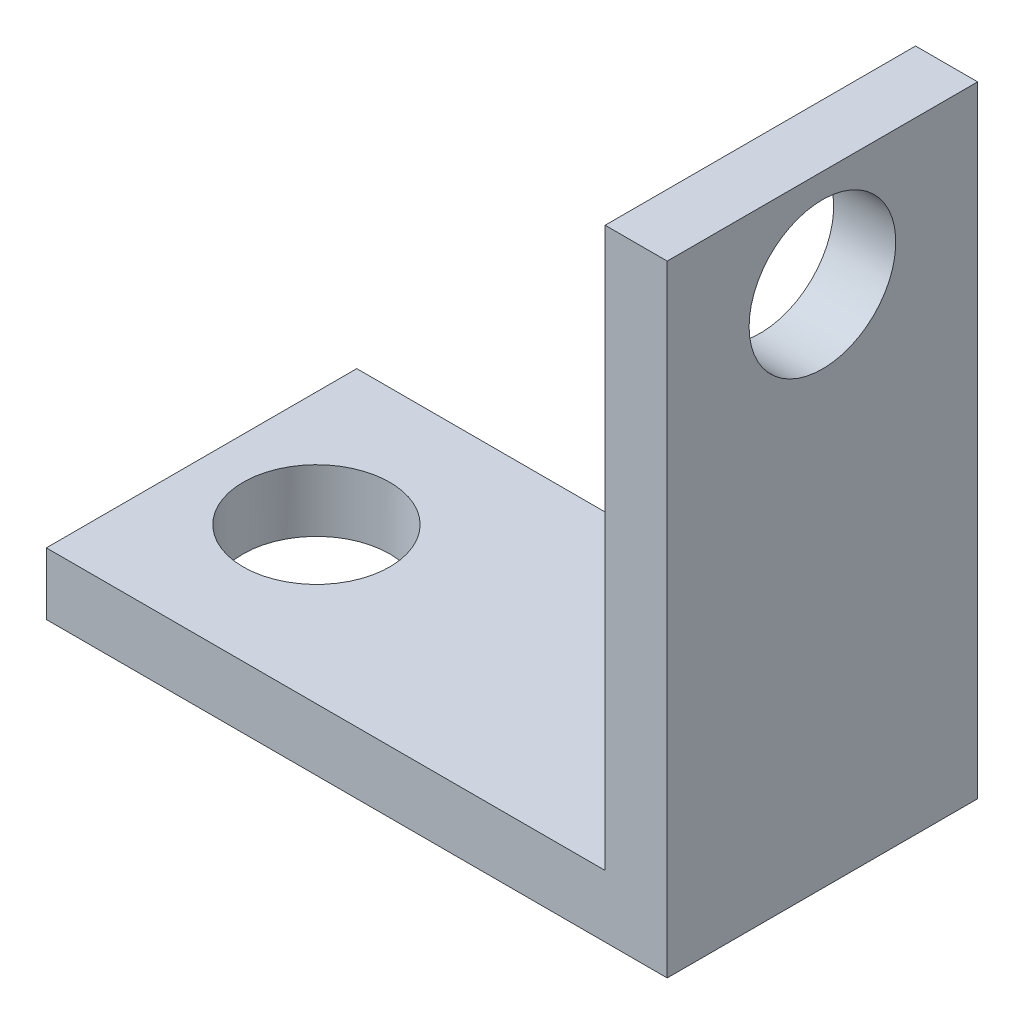
ISO-10303-21;
HEADER;
FILE_DESCRIPTION(('STEP AP214'),'2;1');
FILE_NAME('part.step','',(''),(''),'','','');
FILE_SCHEMA(('AUTOMOTIVE_DESIGN { 1 0 10303 214 1 1 1 1 }'));
ENDSEC;
DATA;
#1=APPLICATION_CONTEXT('core data for automotive mechanical design processes');
#2=APPLICATION_PROTOCOL_DEFINITION('international standard','automotive_design',2000,#1);
#3=PRODUCT_CONTEXT('',#1,'mechanical');
#4=PRODUCT('Part','Part','',(#3));
#5=PRODUCT_RELATED_PRODUCT_CATEGORY('part','',(#4));
#6=PRODUCT_DEFINITION_FORMATION('','',#4);
#7=PRODUCT_DEFINITION_CONTEXT('part definition',#1,'design');
#8=PRODUCT_DEFINITION('design','',#6,#7);
#9=PRODUCT_DEFINITION_SHAPE('','',#8);
#10=(LENGTH_UNIT() NAMED_UNIT(*) SI_UNIT(.MILLI.,.METRE.));
#11=(NAMED_UNIT(*) PLANE_ANGLE_UNIT() SI_UNIT($,.RADIAN.));
#12=(NAMED_UNIT(*) SI_UNIT($,.STERADIAN.) SOLID_ANGLE_UNIT());
#13=UNCERTAINTY_MEASURE_WITH_UNIT(LENGTH_MEASURE(1.E-05),#10,'distance_accuracy_value','');
#14=(GEOMETRIC_REPRESENTATION_CONTEXT(3) GLOBAL_UNCERTAINTY_ASSIGNED_CONTEXT((#13)) GLOBAL_UNIT_ASSIGNED_CONTEXT((#10,
#11,#12)) REPRESENTATION_CONTEXT('',''));
#15=CARTESIAN_POINT('',(0.,0.,0.));
#16=DIRECTION('',(0.,0.,1.));
#17=DIRECTION('',(1.,0.,0.));
#18=AXIS2_PLACEMENT_3D('',#15,#16,#17);
#19=CARTESIAN_POINT('',(0.,2.54,0.));
#20=DIRECTION('',(0.,-1.,0.));
#21=DIRECTION('',(0.,0.,-1.));
#22=AXIS2_PLACEMENT_3D('',#19,#20,#21);
#23=PLANE('',#22);
#24=CARTESIAN_POINT('',(-8.,2.54,0.));
#25=DIRECTION('',(0.,1.,0.));
#26=DIRECTION('',(0.,0.,1.));
#27=AXIS2_PLACEMENT_3D('',#24,#25,#26);
#28=CIRCLE('',#27,3.);
#29=CARTESIAN_POINT('',(-8.,2.54,3.));
#30=VERTEX_POINT('',#29);
#31=EDGE_CURVE('E170',#30,#30,#28,.T.);
#32=ORIENTED_EDGE('',*,*,#31,.F.);
#33=EDGE_LOOP('',(#32));
#34=FACE_BOUND('',#33,.T.);
#35=DIRECTION('',(0.,0.,1.));
#36=VECTOR('',#35,1.);
#37=CARTESIAN_POINT('',(10.16,2.54,-6.35));
#38=LINE('',#37,#36);
#39=CARTESIAN_POINT('',(10.16,2.54,-6.35));
#40=VERTEX_POINT('',#39);
#41=CARTESIAN_POINT('',(10.16,2.54,6.35));
#42=VERTEX_POINT('',#41);
#43=EDGE_CURVE('E55',#40,#42,#38,.T.);
#44=ORIENTED_EDGE('',*,*,#43,.F.);
#45=DIRECTION('',(-1.,0.,0.));
#46=VECTOR('',#45,1.);
#47=CARTESIAN_POINT('',(12.7,2.54,-6.35));
#48=LINE('',#47,#46);
#49=CARTESIAN_POINT('',(-12.7,2.54,-6.35));
#50=VERTEX_POINT('',#49);
#51=EDGE_CURVE('E60',#40,#50,#48,.T.);
#52=ORIENTED_EDGE('',*,*,#51,.T.);
#53=DIRECTION('',(0.,0.,1.));
#54=VECTOR('',#53,1.);
#55=CARTESIAN_POINT('',(-12.7,2.54,-6.35));
#56=LINE('',#55,#54);
#57=CARTESIAN_POINT('',(-12.7,2.54,6.35));
#58=VERTEX_POINT('',#57);
#59=EDGE_CURVE('E92',#50,#58,#56,.T.);
#60=ORIENTED_EDGE('',*,*,#59,.T.);
#61=DIRECTION('',(1.,0.,0.));
#62=VECTOR('',#61,1.);
#63=CARTESIAN_POINT('',(12.7,2.54,6.35));
#64=LINE('',#63,#62);
#65=EDGE_CURVE('E155',#58,#42,#64,.T.);
#66=ORIENTED_EDGE('',*,*,#65,.T.);
#67=EDGE_LOOP('',(#44,#52,#60,#66));
#68=FACE_BOUND('',#67,.T.);
#69=ADVANCED_FACE('F38',(#34,#68),#23,.F.);
#70=CARTESIAN_POINT('',(-12.7,2.54,-6.35));
#71=DIRECTION('',(1.,0.,0.));
#72=DIRECTION('',(0.,0.,-1.));
#73=AXIS2_PLACEMENT_3D('',#70,#71,#72);
#74=PLANE('',#73);
#75=DIRECTION('',(0.,0.,1.));
#76=VECTOR('',#75,1.);
#77=CARTESIAN_POINT('',(-12.7,0.,-6.35));
#78=LINE('',#77,#76);
#79=CARTESIAN_POINT('',(-12.7,0.,-6.35));
#80=VERTEX_POINT('',#79);
#81=CARTESIAN_POINT('',(-12.7,0.,6.35));
#82=VERTEX_POINT('',#81);
#83=EDGE_CURVE('E98',#80,#82,#78,.T.);
#84=ORIENTED_EDGE('',*,*,#83,.T.);
#85=DIRECTION('',(0.,-1.,0.));
#86=VECTOR('',#85,1.);
#87=CARTESIAN_POINT('',(-12.7,2.54,6.35));
#88=LINE('',#87,#86);
#89=EDGE_CURVE('E11',#58,#82,#88,.T.);
#90=ORIENTED_EDGE('',*,*,#89,.F.);
#91=ORIENTED_EDGE('',*,*,#59,.F.);
#92=DIRECTION('',(0.,-1.,0.));
#93=VECTOR('',#92,1.);
#94=CARTESIAN_POINT('',(-12.7,2.54,-6.35));
#95=LINE('',#94,#93);
#96=EDGE_CURVE('E83',#50,#80,#95,.T.);
#97=ORIENTED_EDGE('',*,*,#96,.T.);
#98=EDGE_LOOP('',(#84,#90,#91,#97));
#99=FACE_BOUND('',#98,.T.);
#100=ADVANCED_FACE('F40',(#99),#74,.F.);
#101=CARTESIAN_POINT('',(12.7,2.54,6.35));
#102=DIRECTION('',(0.,0.,-1.));
#103=DIRECTION('',(-1.,0.,0.));
#104=AXIS2_PLACEMENT_3D('',#101,#102,#103);
#105=PLANE('',#104);
#106=DIRECTION('',(1.,0.,0.));
#107=VECTOR('',#106,1.);
#108=CARTESIAN_POINT('',(12.7,0.,6.35));
#109=LINE('',#108,#107);
#110=CARTESIAN_POINT('',(12.7,0.,6.35));
#111=VERTEX_POINT('',#110);
#112=EDGE_CURVE('E102',#82,#111,#109,.T.);
#113=ORIENTED_EDGE('',*,*,#112,.T.);
#114=DIRECTION('',(0.,-1.,0.));
#115=VECTOR('',#114,1.);
#116=CARTESIAN_POINT('',(12.7,2.54,6.35));
#117=LINE('',#116,#115);
#118=CARTESIAN_POINT('',(12.7,25.4,6.35));
#119=VERTEX_POINT('',#118);
#120=EDGE_CURVE('E48',#119,#111,#117,.T.);
#121=ORIENTED_EDGE('',*,*,#120,.F.);
#122=DIRECTION('',(1.,0.,0.));
#123=VECTOR('',#122,1.);
#124=CARTESIAN_POINT('',(12.7,25.4,6.35));
#125=LINE('',#124,#123);
#126=CARTESIAN_POINT('',(10.16,25.4,6.35));
#127=VERTEX_POINT('',#126);
#128=EDGE_CURVE('E133',#127,#119,#125,.T.);
#129=ORIENTED_EDGE('',*,*,#128,.F.);
#130=DIRECTION('',(0.,-1.,0.));
#131=VECTOR('',#130,1.);
#132=CARTESIAN_POINT('',(10.16,25.4,6.35));
#133=LINE('',#132,#131);
#134=EDGE_CURVE('E110',#127,#42,#133,.T.);
#135=ORIENTED_EDGE('',*,*,#134,.T.);
#136=ORIENTED_EDGE('',*,*,#65,.F.);
#137=ORIENTED_EDGE('',*,*,#89,.T.);
#138=EDGE_LOOP('',(#113,#121,#129,#135,#136,#137));
#139=FACE_BOUND('',#138,.T.);
#140=ADVANCED_FACE('F130',(#139),#105,.F.);
#141=CARTESIAN_POINT('',(12.7,2.54,-6.35));
#142=DIRECTION('',(-1.,0.,0.));
#143=DIRECTION('',(0.,0.,1.));
#144=AXIS2_PLACEMENT_3D('',#141,#142,#143);
#145=PLANE('',#144);
#146=CARTESIAN_POINT('',(12.7,21.4,0.));
#147=DIRECTION('',(-1.,0.,0.));
#148=DIRECTION('',(0.,0.,1.));
#149=AXIS2_PLACEMENT_3D('',#146,#147,#148);
#150=CIRCLE('',#149,3.);
#151=CARTESIAN_POINT('',(12.7,21.4,3.));
#152=VERTEX_POINT('',#151);
#153=EDGE_CURVE('E174',#152,#152,#150,.T.);
#154=ORIENTED_EDGE('',*,*,#153,.T.);
#155=EDGE_LOOP('',(#154));
#156=FACE_BOUND('',#155,.T.);
#157=DIRECTION('',(0.,0.,-1.));
#158=VECTOR('',#157,1.);
#159=CARTESIAN_POINT('',(12.7,0.,-6.35));
#160=LINE('',#159,#158);
#161=CARTESIAN_POINT('',(12.7,0.,-6.35));
#162=VERTEX_POINT('',#161);
#163=EDGE_CURVE('E93',#111,#162,#160,.T.);
#164=ORIENTED_EDGE('',*,*,#163,.T.);
#165=DIRECTION('',(0.,-1.,0.));
#166=VECTOR('',#165,1.);
#167=CARTESIAN_POINT('',(12.7,2.54,-6.35));
#168=LINE('',#167,#166);
#169=CARTESIAN_POINT('',(12.7,25.4,-6.35));
#170=VERTEX_POINT('',#169);
#171=EDGE_CURVE('E87',#170,#162,#168,.T.);
#172=ORIENTED_EDGE('',*,*,#171,.F.);
#173=DIRECTION('',(0.,0.,-1.));
#174=VECTOR('',#173,1.);
#175=CARTESIAN_POINT('',(12.7,25.4,-6.35));
#176=LINE('',#175,#174);
#177=EDGE_CURVE('E126',#119,#170,#176,.T.);
#178=ORIENTED_EDGE('',*,*,#177,.F.);
#179=ORIENTED_EDGE('',*,*,#120,.T.);
#180=EDGE_LOOP('',(#164,#172,#178,#179));
#181=FACE_BOUND('',#180,.T.);
#182=ADVANCED_FACE('F124',(#156,#181),#145,.F.);
#183=CARTESIAN_POINT('',(12.7,2.54,-6.35));
#184=DIRECTION('',(0.,0.,1.));
#185=DIRECTION('',(1.,0.,0.));
#186=AXIS2_PLACEMENT_3D('',#183,#184,#185);
#187=PLANE('',#186);
#188=DIRECTION('',(-1.,0.,0.));
#189=VECTOR('',#188,1.);
#190=CARTESIAN_POINT('',(12.7,0.,-6.35));
#191=LINE('',#190,#189);
#192=EDGE_CURVE('E80',#162,#80,#191,.T.);
#193=ORIENTED_EDGE('',*,*,#192,.T.);
#194=ORIENTED_EDGE('',*,*,#96,.F.);
#195=ORIENTED_EDGE('',*,*,#51,.F.);
#196=DIRECTION('',(0.,-1.,0.));
#197=VECTOR('',#196,1.);
#198=CARTESIAN_POINT('',(10.16,25.4,-6.35));
#199=LINE('',#198,#197);
#200=CARTESIAN_POINT('',(10.16,25.4,-6.35));
#201=VERTEX_POINT('',#200);
#202=EDGE_CURVE('E104',#201,#40,#199,.T.);
#203=ORIENTED_EDGE('',*,*,#202,.F.);
#204=DIRECTION('',(-1.,0.,0.));
#205=VECTOR('',#204,1.);
#206=CARTESIAN_POINT('',(12.7,25.4,-6.35));
#207=LINE('',#206,#205);
#208=EDGE_CURVE('E148',#170,#201,#207,.T.);
#209=ORIENTED_EDGE('',*,*,#208,.F.);
#210=ORIENTED_EDGE('',*,*,#171,.T.);
#211=EDGE_LOOP('',(#193,#194,#195,#203,#209,#210));
#212=FACE_BOUND('',#211,.T.);
#213=ADVANCED_FACE('F82',(#212),#187,.F.);
#214=CARTESIAN_POINT('',(0.,0.,0.));
#215=DIRECTION('',(0.,-1.,0.));
#216=DIRECTION('',(0.,0.,-1.));
#217=AXIS2_PLACEMENT_3D('',#214,#215,#216);
#218=PLANE('',#217);
#219=CARTESIAN_POINT('',(-8.,0.,0.));
#220=DIRECTION('',(0.,-1.,0.));
#221=DIRECTION('',(0.,0.,-1.));
#222=AXIS2_PLACEMENT_3D('',#219,#220,#221);
#223=CIRCLE('',#222,3.);
#224=CARTESIAN_POINT('',(-8.,0.,-3.));
#225=VERTEX_POINT('',#224);
#226=EDGE_CURVE('E42',#225,#225,#223,.T.);
#227=ORIENTED_EDGE('',*,*,#226,.F.);
#228=EDGE_LOOP('',(#227));
#229=FACE_BOUND('',#228,.T.);
#230=ORIENTED_EDGE('',*,*,#83,.F.);
#231=ORIENTED_EDGE('',*,*,#192,.F.);
#232=ORIENTED_EDGE('',*,*,#163,.F.);
#233=ORIENTED_EDGE('',*,*,#112,.F.);
#234=EDGE_LOOP('',(#230,#231,#232,#233));
#235=FACE_BOUND('',#234,.T.);
#236=ADVANCED_FACE('F101',(#229,#235),#218,.T.);
#237=CARTESIAN_POINT('',(10.16,25.4,-6.35));
#238=DIRECTION('',(1.,0.,0.));
#239=DIRECTION('',(0.,0.,-1.));
#240=AXIS2_PLACEMENT_3D('',#237,#238,#239);
#241=PLANE('',#240);
#242=CARTESIAN_POINT('',(10.16,21.4,0.));
#243=DIRECTION('',(-1.,0.,0.));
#244=DIRECTION('',(0.,0.,1.));
#245=AXIS2_PLACEMENT_3D('',#242,#243,#244);
#246=CIRCLE('',#245,3.);
#247=CARTESIAN_POINT('',(10.16,21.4,3.));
#248=VERTEX_POINT('',#247);
#249=EDGE_CURVE('E178',#248,#248,#246,.T.);
#250=ORIENTED_EDGE('',*,*,#249,.F.);
#251=EDGE_LOOP('',(#250));
#252=FACE_BOUND('',#251,.T.);
#253=ORIENTED_EDGE('',*,*,#43,.T.);
#254=ORIENTED_EDGE('',*,*,#134,.F.);
#255=DIRECTION('',(0.,0.,1.));
#256=VECTOR('',#255,1.);
#257=CARTESIAN_POINT('',(10.16,25.4,-6.35));
#258=LINE('',#257,#256);
#259=EDGE_CURVE('E141',#201,#127,#258,.T.);
#260=ORIENTED_EDGE('',*,*,#259,.F.);
#261=ORIENTED_EDGE('',*,*,#202,.T.);
#262=EDGE_LOOP('',(#253,#254,#260,#261));
#263=FACE_BOUND('',#262,.T.);
#264=ADVANCED_FACE('F160',(#252,#263),#241,.F.);
#265=CARTESIAN_POINT('',(0.,25.4,0.));
#266=DIRECTION('',(0.,-1.,0.));
#267=DIRECTION('',(0.,0.,-1.));
#268=AXIS2_PLACEMENT_3D('',#265,#266,#267);
#269=PLANE('',#268);
#270=ORIENTED_EDGE('',*,*,#177,.T.);
#271=ORIENTED_EDGE('',*,*,#208,.T.);
#272=ORIENTED_EDGE('',*,*,#259,.T.);
#273=ORIENTED_EDGE('',*,*,#128,.T.);
#274=EDGE_LOOP('',(#270,#271,#272,#273));
#275=FACE_BOUND('',#274,.T.);
#276=ADVANCED_FACE('F137',(#275),#269,.F.);
#277=CARTESIAN_POINT('',(-8.,-20.32,0.));
#278=DIRECTION('',(0.,1.,0.));
#279=DIRECTION('',(0.,0.,1.));
#280=AXIS2_PLACEMENT_3D('',#277,#278,#279);
#281=CYLINDRICAL_SURFACE('',#280,3.);
#282=ORIENTED_EDGE('',*,*,#226,.T.);
#283=EDGE_LOOP('',(#282));
#284=FACE_BOUND('',#283,.T.);
#285=ORIENTED_EDGE('',*,*,#31,.T.);
#286=EDGE_LOOP('',(#285));
#287=FACE_BOUND('',#286,.T.);
#288=ADVANCED_FACE('F193',(#284,#287),#281,.F.);
#289=CARTESIAN_POINT('',(33.02,21.4,0.));
#290=DIRECTION('',(-1.,0.,0.));
#291=DIRECTION('',(0.,0.,1.));
#292=AXIS2_PLACEMENT_3D('',#289,#290,#291);
#293=CYLINDRICAL_SURFACE('',#292,3.);
#294=ORIENTED_EDGE('',*,*,#249,.T.);
#295=EDGE_LOOP('',(#294));
#296=FACE_BOUND('',#295,.T.);
#297=ORIENTED_EDGE('',*,*,#153,.F.);
#298=EDGE_LOOP('',(#297));
#299=FACE_BOUND('',#298,.T.);
#300=ADVANCED_FACE('F183',(#296,#299),#293,.F.);
#301=CLOSED_SHELL('',(#69,#100,#140,#182,#213,#236,#264,#276,#288,#300));
#302=MANIFOLD_SOLID_BREP('B2',#301);
#303=ADVANCED_BREP_SHAPE_REPRESENTATION('',(#18,#302),#14);
#304=SHAPE_DEFINITION_REPRESENTATION(#9,#303);
ENDSEC;
END-ISO-10303-21;
